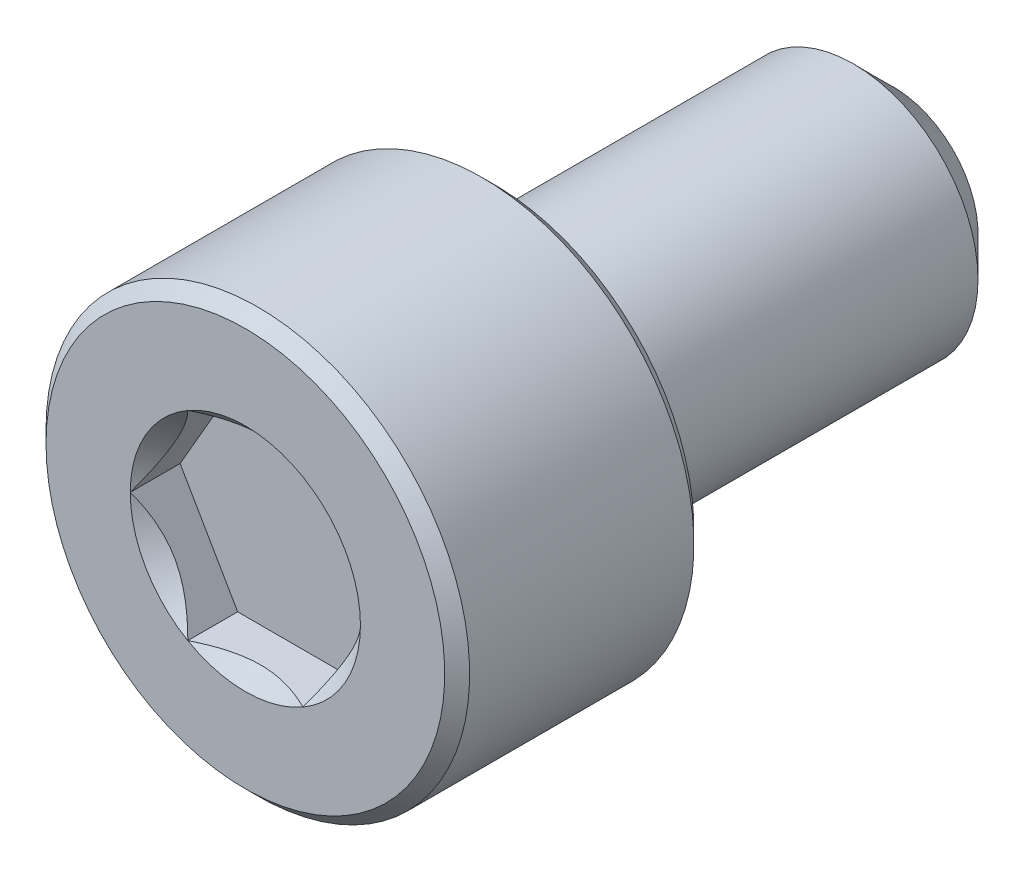
ISO-10303-21;
HEADER;
FILE_DESCRIPTION(('STEP AP214'),'2;1');
FILE_NAME('part.step','',(''),(''),'','','');
FILE_SCHEMA(('AUTOMOTIVE_DESIGN { 1 0 10303 214 1 1 1 1 }'));
ENDSEC;
DATA;
#1=APPLICATION_CONTEXT('core data for automotive mechanical design processes');
#2=APPLICATION_PROTOCOL_DEFINITION('international standard','automotive_design',2000,#1);
#3=PRODUCT_CONTEXT('',#1,'mechanical');
#4=PRODUCT('Part','Part','',(#3));
#5=PRODUCT_RELATED_PRODUCT_CATEGORY('part','',(#4));
#6=PRODUCT_DEFINITION_FORMATION('','',#4);
#7=PRODUCT_DEFINITION_CONTEXT('part definition',#1,'design');
#8=PRODUCT_DEFINITION('design','',#6,#7);
#9=PRODUCT_DEFINITION_SHAPE('','',#8);
#10=(LENGTH_UNIT() NAMED_UNIT(*) SI_UNIT(.MILLI.,.METRE.));
#11=(NAMED_UNIT(*) PLANE_ANGLE_UNIT() SI_UNIT($,.RADIAN.));
#12=(NAMED_UNIT(*) SI_UNIT($,.STERADIAN.) SOLID_ANGLE_UNIT());
#13=UNCERTAINTY_MEASURE_WITH_UNIT(LENGTH_MEASURE(1.E-05),#10,'distance_accuracy_value','');
#14=(GEOMETRIC_REPRESENTATION_CONTEXT(3) GLOBAL_UNCERTAINTY_ASSIGNED_CONTEXT((#13)) GLOBAL_UNIT_ASSIGNED_CONTEXT((#10,
#11,#12)) REPRESENTATION_CONTEXT('',''));
#15=CARTESIAN_POINT('',(0.,0.,0.));
#16=DIRECTION('',(0.,0.,1.));
#17=DIRECTION('',(1.,0.,0.));
#18=AXIS2_PLACEMENT_3D('',#15,#16,#17);
#19=CARTESIAN_POINT('',(0.,4.,6.5));
#20=DIRECTION('',(0.,0.,1.));
#21=DIRECTION('',(1.,0.,0.));
#22=AXIS2_PLACEMENT_3D('',#19,#20,#21);
#23=PLANE('',#22);
#24=CARTESIAN_POINT('',(0.,0.,6.5));
#25=DIRECTION('',(0.,0.,1.));
#26=DIRECTION('',(1.,0.,0.));
#27=AXIS2_PLACEMENT_3D('',#24,#25,#26);
#28=CIRCLE('',#27,2.3094010767585);
#29=CARTESIAN_POINT('',(2.3094010767585,0.,6.5));
#30=VERTEX_POINT('',#29);
#31=CARTESIAN_POINT('',(1.15470053837925,2.,6.5));
#32=VERTEX_POINT('',#31);
#33=EDGE_CURVE('E101',#30,#32,#28,.T.);
#34=ORIENTED_EDGE('',*,*,#33,.F.);
#35=CARTESIAN_POINT('',(1.15470053837925,-2.,6.5));
#36=VERTEX_POINT('',#35);
#37=EDGE_CURVE('E61',#36,#30,#28,.T.);
#38=ORIENTED_EDGE('',*,*,#37,.F.);
#39=CARTESIAN_POINT('',(-1.15470053837925,-2.,6.5));
#40=VERTEX_POINT('',#39);
#41=EDGE_CURVE('E331',#40,#36,#28,.T.);
#42=ORIENTED_EDGE('',*,*,#41,.F.);
#43=CARTESIAN_POINT('',(-2.3094010767585,0.,6.5));
#44=VERTEX_POINT('',#43);
#45=EDGE_CURVE('E68',#44,#40,#28,.T.);
#46=ORIENTED_EDGE('',*,*,#45,.F.);
#47=CARTESIAN_POINT('',(-1.15470053837925,2.,6.5));
#48=VERTEX_POINT('',#47);
#49=EDGE_CURVE('E139',#48,#44,#28,.T.);
#50=ORIENTED_EDGE('',*,*,#49,.F.);
#51=EDGE_CURVE('E111',#32,#48,#28,.T.);
#52=ORIENTED_EDGE('',*,*,#51,.F.);
#53=EDGE_LOOP('',(#34,#38,#42,#46,#50,#52));
#54=FACE_BOUND('',#53,.T.);
#55=CARTESIAN_POINT('',(0.,0.,6.5));
#56=DIRECTION('',(0.,0.,-1.));
#57=DIRECTION('',(-1.,0.,0.));
#58=AXIS2_PLACEMENT_3D('',#55,#56,#57);
#59=CIRCLE('',#58,4.);
#60=CARTESIAN_POINT('',(-4.,0.,6.5));
#61=VERTEX_POINT('',#60);
#62=EDGE_CURVE('E55',#61,#61,#59,.T.);
#63=ORIENTED_EDGE('',*,*,#62,.F.);
#64=EDGE_LOOP('',(#63));
#65=FACE_BOUND('',#64,.T.);
#66=ADVANCED_FACE('F41',(#54,#65),#23,.T.);
#67=CARTESIAN_POINT('',(0.,0.,6.25));
#68=DIRECTION('',(0.,0.,-1.));
#69=DIRECTION('',(-1.,0.,0.));
#70=AXIS2_PLACEMENT_3D('',#67,#68,#69);
#71=CONICAL_SURFACE('',#70,4.25,0.785398163397452);
#72=ORIENTED_EDGE('',*,*,#62,.T.);
#73=EDGE_LOOP('',(#72));
#74=FACE_BOUND('',#73,.T.);
#75=CARTESIAN_POINT('',(0.,0.,6.25));
#76=DIRECTION('',(0.,0.,-1.));
#77=DIRECTION('',(-1.,0.,0.));
#78=AXIS2_PLACEMENT_3D('',#75,#76,#77);
#79=CIRCLE('',#78,4.25);
#80=CARTESIAN_POINT('',(-4.25,0.,6.25));
#81=VERTEX_POINT('',#80);
#82=EDGE_CURVE('E299',#81,#81,#79,.T.);
#83=ORIENTED_EDGE('',*,*,#82,.F.);
#84=EDGE_LOOP('',(#83));
#85=FACE_BOUND('',#84,.T.);
#86=ADVANCED_FACE('F207',(#74,#85),#71,.T.);
#87=CARTESIAN_POINT('',(0.,0.,-6.5));
#88=DIRECTION('',(0.,0.,-1.));
#89=DIRECTION('',(-1.,0.,0.));
#90=AXIS2_PLACEMENT_3D('',#87,#88,#89);
#91=CYLINDRICAL_SURFACE('',#90,4.25);
#92=ORIENTED_EDGE('',*,*,#82,.T.);
#93=EDGE_LOOP('',(#92));
#94=FACE_BOUND('',#93,.T.);
#95=CARTESIAN_POINT('',(0.,0.,1.75));
#96=DIRECTION('',(0.,0.,-1.));
#97=DIRECTION('',(-1.,0.,0.));
#98=AXIS2_PLACEMENT_3D('',#95,#96,#97);
#99=CIRCLE('',#98,4.25);
#100=CARTESIAN_POINT('',(-4.25,0.,1.75));
#101=VERTEX_POINT('',#100);
#102=EDGE_CURVE('E295',#101,#101,#99,.T.);
#103=ORIENTED_EDGE('',*,*,#102,.F.);
#104=EDGE_LOOP('',(#103));
#105=FACE_BOUND('',#104,.T.);
#106=ADVANCED_FACE('F211',(#94,#105),#91,.T.);
#107=CARTESIAN_POINT('',(0.,0.,1.5));
#108=DIRECTION('',(0.,0.,1.));
#109=DIRECTION('',(1.,0.,0.));
#110=AXIS2_PLACEMENT_3D('',#107,#108,#109);
#111=CONICAL_SURFACE('',#110,4.,0.785398163397448);
#112=ORIENTED_EDGE('',*,*,#102,.T.);
#113=EDGE_LOOP('',(#112));
#114=FACE_BOUND('',#113,.T.);
#115=CARTESIAN_POINT('',(0.,0.,1.5));
#116=DIRECTION('',(0.,0.,-1.));
#117=DIRECTION('',(-1.,0.,0.));
#118=AXIS2_PLACEMENT_3D('',#115,#116,#117);
#119=CIRCLE('',#118,4.);
#120=CARTESIAN_POINT('',(-4.,0.,1.5));
#121=VERTEX_POINT('',#120);
#122=EDGE_CURVE('E291',#121,#121,#119,.T.);
#123=ORIENTED_EDGE('',*,*,#122,.F.);
#124=EDGE_LOOP('',(#123));
#125=FACE_BOUND('',#124,.T.);
#126=ADVANCED_FACE('F216',(#114,#125),#111,.T.);
#127=CARTESIAN_POINT('',(0.,4.,1.5));
#128=DIRECTION('',(0.,0.,-1.));
#129=DIRECTION('',(-1.,0.,0.));
#130=AXIS2_PLACEMENT_3D('',#127,#128,#129);
#131=PLANE('',#130);
#132=ORIENTED_EDGE('',*,*,#122,.T.);
#133=EDGE_LOOP('',(#132));
#134=FACE_BOUND('',#133,.T.);
#135=CARTESIAN_POINT('',(0.,0.,1.5));
#136=DIRECTION('',(0.,0.,-1.));
#137=DIRECTION('',(-1.,0.,0.));
#138=AXIS2_PLACEMENT_3D('',#135,#136,#137);
#139=CIRCLE('',#138,2.5);
#140=CARTESIAN_POINT('',(-2.5,0.,1.5));
#141=VERTEX_POINT('',#140);
#142=EDGE_CURVE('E287',#141,#141,#139,.T.);
#143=ORIENTED_EDGE('',*,*,#142,.F.);
#144=EDGE_LOOP('',(#143));
#145=FACE_BOUND('',#144,.T.);
#146=ADVANCED_FACE('F224',(#134,#145),#131,.T.);
#147=CARTESIAN_POINT('',(0.,0.,-6.5));
#148=DIRECTION('',(0.,0.,-1.));
#149=DIRECTION('',(-1.,0.,0.));
#150=AXIS2_PLACEMENT_3D('',#147,#148,#149);
#151=CYLINDRICAL_SURFACE('',#150,2.5);
#152=ORIENTED_EDGE('',*,*,#142,.T.);
#153=EDGE_LOOP('',(#152));
#154=FACE_BOUND('',#153,.T.);
#155=CARTESIAN_POINT('',(0.,0.,-5.69999999999999));
#156=DIRECTION('',(0.,0.,-1.));
#157=DIRECTION('',(-1.,0.,0.));
#158=AXIS2_PLACEMENT_3D('',#155,#156,#157);
#159=CIRCLE('',#158,2.5);
#160=CARTESIAN_POINT('',(-2.5,0.,-5.69999999999999));
#161=VERTEX_POINT('',#160);
#162=EDGE_CURVE('E283',#161,#161,#159,.T.);
#163=ORIENTED_EDGE('',*,*,#162,.F.);
#164=EDGE_LOOP('',(#163));
#165=FACE_BOUND('',#164,.T.);
#166=ADVANCED_FACE('F228',(#154,#165),#151,.T.);
#167=CARTESIAN_POINT('',(0.,0.,-6.5));
#168=DIRECTION('',(0.,0.,1.));
#169=DIRECTION('',(1.,0.,0.));
#170=AXIS2_PLACEMENT_3D('',#167,#168,#169);
#171=CONICAL_SURFACE('',#170,1.7,0.785398163397443);
#172=ORIENTED_EDGE('',*,*,#162,.T.);
#173=EDGE_LOOP('',(#172));
#174=FACE_BOUND('',#173,.T.);
#175=CARTESIAN_POINT('',(0.,0.,-6.5));
#176=DIRECTION('',(0.,0.,-1.));
#177=DIRECTION('',(-1.,0.,0.));
#178=AXIS2_PLACEMENT_3D('',#175,#176,#177);
#179=CIRCLE('',#178,1.7);
#180=CARTESIAN_POINT('',(-1.7,0.,-6.5));
#181=VERTEX_POINT('',#180);
#182=EDGE_CURVE('E259',#181,#181,#179,.T.);
#183=ORIENTED_EDGE('',*,*,#182,.F.);
#184=EDGE_LOOP('',(#183));
#185=FACE_BOUND('',#184,.T.);
#186=ADVANCED_FACE('F232',(#174,#185),#171,.T.);
#187=CARTESIAN_POINT('',(0.,1.7,-6.5));
#188=DIRECTION('',(0.,0.,-1.));
#189=DIRECTION('',(-1.,0.,0.));
#190=AXIS2_PLACEMENT_3D('',#187,#188,#189);
#191=PLANE('',#190);
#192=ORIENTED_EDGE('',*,*,#182,.T.);
#193=EDGE_LOOP('',(#192));
#194=FACE_BOUND('',#193,.T.);
#195=ADVANCED_FACE('F236',(#194),#191,.T.);
#196=CARTESIAN_POINT('',(0.,0.,6.5));
#197=DIRECTION('',(0.,0.,1.));
#198=DIRECTION('',(1.,0.,0.));
#199=AXIS2_PLACEMENT_3D('',#196,#197,#198);
#200=CONICAL_SURFACE('',#199,2.3094010767585,0.78539816339745);
#201=ORIENTED_EDGE('',*,*,#51,.T.);
#202=CARTESIAN_POINT('',(-2.33350792809313,2.,7.26391297333034));
#203=CARTESIAN_POINT('',(-2.27682524005105,2.,7.22088465819452));
#204=CARTESIAN_POINT('',(-2.21982863127677,2.,7.17826321968666));
#205=CARTESIAN_POINT('',(-2.10508243227164,2.,7.09401735382318));
#206=CARTESIAN_POINT('',(-2.04733265969732,2.,7.05239317509694));
#207=CARTESIAN_POINT('',(-1.93053250768749,2.,6.97002893909808));
#208=CARTESIAN_POINT('',(-1.87147552066419,2.,6.929298220564));
#209=CARTESIAN_POINT('',(-1.75236453496771,2.,6.84932648957119));
#210=CARTESIAN_POINT('',(-1.69231060660119,2.,6.81008537269831));
#211=CARTESIAN_POINT('',(-1.567471533448,2.,6.73116787888498));
#212=CARTESIAN_POINT('',(-1.50261611656329,2.,6.69160210237478));
#213=CARTESIAN_POINT('',(-1.37138716901082,2.,6.61502921587276));
#214=CARTESIAN_POINT('',(-1.30501336962871,2.,6.57802256351504));
#215=CARTESIAN_POINT('',(-1.17075263037878,2.,6.50736673923407));
#216=CARTESIAN_POINT('',(-1.10287104348427,2.,6.47370747514608));
#217=CARTESIAN_POINT('',(-0.96522809254686,2.,6.41049315112672));
#218=CARTESIAN_POINT('',(-0.895467367515903,2.,6.38093671652697));
#219=CARTESIAN_POINT('',(-0.760038155655725,2.,6.32931025785436));
#220=CARTESIAN_POINT('',(-0.694533426178473,2.,6.30681508107925));
#221=CARTESIAN_POINT('',(-0.561920164972266,2.,6.26707588844303));
#222=CARTESIAN_POINT('',(-0.494811525645962,2.,6.24983222594906));
#223=CARTESIAN_POINT('',(-0.360522211095494,2.,6.22179275650282));
#224=CARTESIAN_POINT('',(-0.293365389163157,2.,6.21088458822735));
#225=CARTESIAN_POINT('',(-0.158300090029279,2.,6.19573270261191));
#226=CARTESIAN_POINT('',(-0.0903917516002764,2.,6.19148777487641));
#227=CARTESIAN_POINT('',(0.0429020652606317,2.,6.18999114215311));
#228=CARTESIAN_POINT('',(0.108284684169079,2.,6.1924781450741));
#229=CARTESIAN_POINT('',(0.23850440969295,2.,6.20372439320255));
#230=CARTESIAN_POINT('',(0.303341463641696,2.,6.21248423709365));
#231=CARTESIAN_POINT('',(0.433098840648744,2.,6.23594152298035));
#232=CARTESIAN_POINT('',(0.498000415627631,2.,6.25074108464347));
#233=CARTESIAN_POINT('',(0.626381661351717,2.,6.28548203883061));
#234=CARTESIAN_POINT('',(0.689861439952175,2.,6.3054230398874));
#235=CARTESIAN_POINT('',(0.888345745687482,2.,6.37531214536041));
#236=CARTESIAN_POINT('',(1.02055912670982,2.,6.43316247106279));
#237=CARTESIAN_POINT('',(1.27879697777602,2.,6.56182319594991));
#238=CARTESIAN_POINT('',(1.40479723810912,2.,6.63267988107336));
#239=CARTESIAN_POINT('',(1.58692013279986,2.,6.74327963632549));
#240=CARTESIAN_POINT('',(1.64501521895223,2.,6.77983824352554));
#241=CARTESIAN_POINT('',(1.76020814703228,2.,6.85450591449783));
#242=CARTESIAN_POINT('',(1.81730591318335,2.,6.8926150953569));
#243=CARTESIAN_POINT('',(1.93017247334116,2.,6.96978646473081));
#244=CARTESIAN_POINT('',(1.9859482832833,2.,7.00883844345984));
#245=CARTESIAN_POINT('',(2.09673667795809,2.,7.08797979648984));
#246=CARTESIAN_POINT('',(2.15174946854703,2.,7.1280688822828));
#247=CARTESIAN_POINT('',(2.20644261038877,2.,7.16858297171107));
#248=B_SPLINE_CURVE_WITH_KNOTS('',3,(#202,#203,#204,#205,#206,#207,#208,#209,#210,#211,#212,
#213,#214,#215,#216,#217,#218,#219,#220,#221,#222,#223,#224,#225,#226,#227,#228,#229,#230,#231,
#232,#233,#234,#235,#236,#237,#238,#239,#240,#241,#242,#243,#244,#245,#246,#247),.UNSPECIFIED.,
.F.,.F.,(4,2,2,2,2,2,2,2,2,2,2,2,2,2,2,2,2,2,2,2,2,2,4),(0.,0.213497148294752,0.427046981593394,
0.642249974749849,0.857437855216921,1.08530552050929,1.31321382930987,1.54041273599371,
1.76753533413947,1.97513287362836,2.18274437898411,2.38655158594355,2.59032176649044,
2.78629737352115,2.98229168707252,3.18174703964799,3.38118721025193,3.81287365989454,
4.24612724012855,4.45203046308782,4.65794926316182,4.86220142187745,5.06639735899164),.UNSPECIFIED.);
#249=EDGE_CURVE('E12',#32,#48,#248,.F.);
#250=ORIENTED_EDGE('',*,*,#249,.F.);
#251=EDGE_LOOP('',(#201,#250));
#252=FACE_BOUND('',#251,.T.);
#253=ADVANCED_FACE('F115',(#252),#200,.F.);
#254=ORIENTED_EDGE('',*,*,#49,.T.);
#255=CARTESIAN_POINT('',(-1.15458506832541,2.0002,6.50011547871366));
#256=CARTESIAN_POINT('',(-1.19427965103064,1.93144696596929,6.46045309022559));
#257=CARTESIAN_POINT('',(-1.23463799837204,1.86154425786449,6.42311998228416));
#258=CARTESIAN_POINT('',(-1.31693321846145,1.71900475544956,6.35476368513614));
#259=CARTESIAN_POINT('',(-1.35887791933134,1.64635440243464,6.32377853373722));
#260=CARTESIAN_POINT('',(-1.44345742638069,1.49985839894603,6.27070021654414));
#261=CARTESIAN_POINT('',(-1.48607068799507,1.42605006475371,6.24847362717661));
#262=CARTESIAN_POINT('',(-1.57223542169503,1.27680836816474,6.21422881667508));
#263=CARTESIAN_POINT('',(-1.61578426088223,1.20137956608185,6.20218502914414));
#264=CARTESIAN_POINT('',(-1.69083694766536,1.07138449932892,6.19131851190557));
#265=CARTESIAN_POINT('',(-1.72224381117151,1.01698621602989,6.18970975360997));
#266=CARTESIAN_POINT('',(-1.78500621460364,0.908278544480308,6.19241887759871));
#267=CARTESIAN_POINT('',(-1.81636173267754,0.853969194078662,6.19673883775797));
#268=CARTESIAN_POINT('',(-1.87877671565355,0.745863272410663,6.21105956740991));
#269=CARTESIAN_POINT('',(-1.90983580972306,0.692067343445209,6.22106669276201));
#270=CARTESIAN_POINT('',(-1.97141691651547,0.585405737694428,6.24621243024966));
#271=CARTESIAN_POINT('',(-2.00193897021859,0.532539989929289,6.26135064904224));
#272=CARTESIAN_POINT('',(-2.08012358375727,0.397120266910157,6.30629450342919));
#273=CARTESIAN_POINT('',(-2.12730124240478,0.315406165150523,6.33948883942582));
#274=CARTESIAN_POINT('',(-2.19667172615922,0.195252962742199,6.39552582317137));
#275=CARTESIAN_POINT('',(-2.21953238052245,0.155657147890824,6.41521470294694));
#276=CARTESIAN_POINT('',(-2.26483018959123,0.0771990411121286,6.45638731836487));
#277=CARTESIAN_POINT('',(-2.28726759416161,0.0383363164062604,6.47786995165125));
#278=CARTESIAN_POINT('',(-2.30951654681234,-0.000199999999999359,6.50011547871366));
#279=B_SPLINE_CURVE_WITH_KNOTS('',3,(#255,#256,#257,#258,#259,#260,#261,#262,#263,#264,#265,
#266,#267,#268,#269,#270,#271,#272,#273,#274,#275,#276,#277,#278),.UNSPECIFIED.,.F.,.F.,(4,2,2,
2,2,2,2,2,2,2,2,4),(0.,0.266420613771063,0.534393751523388,0.798110374376913,1.06116288956936,
1.24939906803721,1.43770123566247,1.62621426093931,1.81471283831913,2.11415604834145,
2.2634717071779,2.41269626969771),.UNSPECIFIED.);
#280=EDGE_CURVE('E110',#48,#44,#279,.T.);
#281=ORIENTED_EDGE('',*,*,#280,.F.);
#282=EDGE_LOOP('',(#254,#281));
#283=FACE_BOUND('',#282,.T.);
#284=ADVANCED_FACE('F342',(#283),#200,.F.);
#285=ORIENTED_EDGE('',*,*,#45,.T.);
#286=CARTESIAN_POINT('',(-2.30951654681234,0.000200000000000642,6.50011547871366));
#287=CARTESIAN_POINT('',(-2.26982196410711,-0.0685530340307052,6.46045309022559));
#288=CARTESIAN_POINT('',(-2.22946361676572,-0.138455742135511,6.42311998228416));
#289=CARTESIAN_POINT('',(-2.1471683966763,-0.280995244550436,6.35476368513614));
#290=CARTESIAN_POINT('',(-2.10522369580642,-0.353645597565358,6.32377853373722));
#291=CARTESIAN_POINT('',(-2.02064418875706,-0.500141601053971,6.27070021654414));
#292=CARTESIAN_POINT('',(-1.97803092714269,-0.573949935246295,6.24847362717661));
#293=CARTESIAN_POINT('',(-1.89186619344273,-0.723191631835264,6.21422881667508));
#294=CARTESIAN_POINT('',(-1.84831735425552,-0.798620433918152,6.20218502914414));
#295=CARTESIAN_POINT('',(-1.77326466747239,-0.92861550067108,6.19131851190557));
#296=CARTESIAN_POINT('',(-1.74185780396625,-0.983013783970109,6.18970975360997));
#297=CARTESIAN_POINT('',(-1.67909540053412,-1.09172145551969,6.19241887759871));
#298=CARTESIAN_POINT('',(-1.64773988246021,-1.14603080592134,6.19673883775797));
#299=CARTESIAN_POINT('',(-1.5853248994842,-1.25413672758934,6.21105956740991));
#300=CARTESIAN_POINT('',(-1.55426580541469,-1.30793265655479,6.22106669276201));
#301=CARTESIAN_POINT('',(-1.49268469862228,-1.41459426230557,6.24621243024966));
#302=CARTESIAN_POINT('',(-1.46216264491916,-1.46746001007071,6.26135064904224));
#303=CARTESIAN_POINT('',(-1.38397803138048,-1.60287973308984,6.30629450342919));
#304=CARTESIAN_POINT('',(-1.33680037273297,-1.68459383484948,6.33948883942582));
#305=CARTESIAN_POINT('',(-1.26742988897853,-1.8047470372578,6.39552582317137));
#306=CARTESIAN_POINT('',(-1.24456923461531,-1.84434285210918,6.41521470294694));
#307=CARTESIAN_POINT('',(-1.19927142554652,-1.92280095888787,6.45638731836487));
#308=CARTESIAN_POINT('',(-1.17683402097614,-1.96166368359374,6.47786995165125));
#309=CARTESIAN_POINT('',(-1.15458506832541,-2.0002,6.50011547871366));
#310=B_SPLINE_CURVE_WITH_KNOTS('',3,(#286,#287,#288,#289,#290,#291,#292,#293,#294,#295,#296,
#297,#298,#299,#300,#301,#302,#303,#304,#305,#306,#307,#308,#309),.UNSPECIFIED.,.F.,.F.,(4,2,2,
2,2,2,2,2,2,2,2,4),(0.,0.266420613771064,0.53439375152339,0.798110374376916,1.06116288956937,
1.24939906803722,1.43770123566248,1.62621426093932,1.81471283831913,2.11415604834145,
2.26347170717791,2.41269626969771),.UNSPECIFIED.);
#311=EDGE_CURVE('E151',#44,#40,#310,.T.);
#312=ORIENTED_EDGE('',*,*,#311,.F.);
#313=EDGE_LOOP('',(#285,#312));
#314=FACE_BOUND('',#313,.T.);
#315=ADVANCED_FACE('F337',(#314),#200,.F.);
#316=ORIENTED_EDGE('',*,*,#41,.T.);
#317=CARTESIAN_POINT('',(-2.33350792809314,-2.,7.26391297333034));
#318=CARTESIAN_POINT('',(-2.27682524005105,-2.,7.22088465819452));
#319=CARTESIAN_POINT('',(-2.21982863127677,-2.,7.17826321968666));
#320=CARTESIAN_POINT('',(-2.10508243227164,-2.,7.09401735382318));
#321=CARTESIAN_POINT('',(-2.04733265969732,-2.,7.05239317509694));
#322=CARTESIAN_POINT('',(-1.9305325076875,-2.,6.97002893909808));
#323=CARTESIAN_POINT('',(-1.87147552066419,-2.,6.929298220564));
#324=CARTESIAN_POINT('',(-1.75236453496771,-2.,6.84932648957119));
#325=CARTESIAN_POINT('',(-1.69231060660119,-2.,6.81008537269831));
#326=CARTESIAN_POINT('',(-1.567471533448,-2.,6.73116787888498));
#327=CARTESIAN_POINT('',(-1.50261611656329,-2.,6.69160210237478));
#328=CARTESIAN_POINT('',(-1.37138716901082,-2.,6.61502921587276));
#329=CARTESIAN_POINT('',(-1.30501336962871,-2.,6.57802256351504));
#330=CARTESIAN_POINT('',(-1.17075263037878,-2.,6.50736673923407));
#331=CARTESIAN_POINT('',(-1.10287104348427,-2.,6.47370747514608));
#332=CARTESIAN_POINT('',(-0.96522809254686,-2.,6.41049315112672));
#333=CARTESIAN_POINT('',(-0.895467367515904,-2.,6.38093671652697));
#334=CARTESIAN_POINT('',(-0.760038155655725,-2.,6.32931025785436));
#335=CARTESIAN_POINT('',(-0.694533426178473,-2.,6.30681508107925));
#336=CARTESIAN_POINT('',(-0.561920164972266,-2.,6.26707588844303));
#337=CARTESIAN_POINT('',(-0.494811525645962,-2.,6.24983222594905));
#338=CARTESIAN_POINT('',(-0.360522211095493,-2.,6.22179275650282));
#339=CARTESIAN_POINT('',(-0.293365389163156,-2.,6.21088458822734));
#340=CARTESIAN_POINT('',(-0.158300090029278,-2.,6.19573270261191));
#341=CARTESIAN_POINT('',(-0.090391751600276,-2.,6.19148777487641));
#342=CARTESIAN_POINT('',(0.0429020652606321,-2.,6.18999114215311));
#343=CARTESIAN_POINT('',(0.10828468416908,-2.,6.1924781450741));
#344=CARTESIAN_POINT('',(0.238504409692951,-2.,6.20372439320255));
#345=CARTESIAN_POINT('',(0.303341463641697,-2.,6.21248423709365));
#346=CARTESIAN_POINT('',(0.433098840648745,-2.,6.23594152298035));
#347=CARTESIAN_POINT('',(0.498000415627632,-2.,6.25074108464347));
#348=CARTESIAN_POINT('',(0.626381661351717,-2.,6.28548203883061));
#349=CARTESIAN_POINT('',(0.689861439952175,-2.,6.3054230398874));
#350=CARTESIAN_POINT('',(0.888345745687483,-2.,6.37531214536041));
#351=CARTESIAN_POINT('',(1.02055912670982,-2.,6.43316247106279));
#352=CARTESIAN_POINT('',(1.27879697777602,-2.,6.56182319594991));
#353=CARTESIAN_POINT('',(1.40479723810912,-2.,6.63267988107336));
#354=CARTESIAN_POINT('',(1.58692013279986,-2.,6.74327963632549));
#355=CARTESIAN_POINT('',(1.64501521895223,-2.,6.77983824352554));
#356=CARTESIAN_POINT('',(1.76020814703228,-2.,6.85450591449783));
#357=CARTESIAN_POINT('',(1.81730591318335,-2.,6.8926150953569));
#358=CARTESIAN_POINT('',(1.93017247334116,-2.,6.96978646473081));
#359=CARTESIAN_POINT('',(1.9859482832833,-2.,7.00883844345984));
#360=CARTESIAN_POINT('',(2.09673667795809,-2.,7.08797979648984));
#361=CARTESIAN_POINT('',(2.15174946854703,-2.,7.1280688822828));
#362=CARTESIAN_POINT('',(2.20644261038877,-2.,7.16858297171107));
#363=B_SPLINE_CURVE_WITH_KNOTS('',3,(#317,#318,#319,#320,#321,#322,#323,#324,#325,#326,#327,
#328,#329,#330,#331,#332,#333,#334,#335,#336,#337,#338,#339,#340,#341,#342,#343,#344,#345,#346,
#347,#348,#349,#350,#351,#352,#353,#354,#355,#356,#357,#358,#359,#360,#361,#362),.UNSPECIFIED.,
.F.,.F.,(4,2,2,2,2,2,2,2,2,2,2,2,2,2,2,2,2,2,2,2,2,2,4),(0.,0.213497148294753,0.427046981593394,
0.642249974749849,0.857437855216922,1.08530552050929,1.31321382930987,1.54041273599371,
1.76753533413947,1.97513287362836,2.18274437898411,2.38655158594355,2.59032176649044,
2.78629737352115,2.98229168707252,3.18174703964799,3.38118721025193,3.81287365989454,
4.24612724012855,4.45203046308782,4.65794926316182,4.86220142187745,5.06639735899164),.UNSPECIFIED.);
#364=EDGE_CURVE('E171',#40,#36,#363,.T.);
#365=ORIENTED_EDGE('',*,*,#364,.F.);
#366=EDGE_LOOP('',(#316,#365));
#367=FACE_BOUND('',#366,.T.);
#368=ADVANCED_FACE('F332',(#367),#200,.F.);
#369=ORIENTED_EDGE('',*,*,#37,.T.);
#370=CARTESIAN_POINT('',(1.15458506832541,-2.0002,6.50011547871366));
#371=CARTESIAN_POINT('',(1.19427965103064,-1.93144696596929,6.46045309022559));
#372=CARTESIAN_POINT('',(1.23463799837204,-1.86154425786449,6.42311998228416));
#373=CARTESIAN_POINT('',(1.31693321846145,-1.71900475544956,6.35476368513614));
#374=CARTESIAN_POINT('',(1.35887791933134,-1.64635440243464,6.32377853373722));
#375=CARTESIAN_POINT('',(1.44345742638069,-1.49985839894603,6.27070021654414));
#376=CARTESIAN_POINT('',(1.48607068799507,-1.42605006475371,6.24847362717661));
#377=CARTESIAN_POINT('',(1.57223542169502,-1.27680836816474,6.21422881667508));
#378=CARTESIAN_POINT('',(1.61578426088223,-1.20137956608185,6.20218502914414));
#379=CARTESIAN_POINT('',(1.69083694766536,-1.07138449932892,6.19131851190557));
#380=CARTESIAN_POINT('',(1.72224381117151,-1.01698621602989,6.18970975360997));
#381=CARTESIAN_POINT('',(1.78500621460364,-0.908278544480307,6.19241887759871));
#382=CARTESIAN_POINT('',(1.81636173267754,-0.853969194078662,6.19673883775797));
#383=CARTESIAN_POINT('',(1.87877671565355,-0.745863272410662,6.21105956740991));
#384=CARTESIAN_POINT('',(1.90983580972306,-0.692067343445208,6.22106669276201));
#385=CARTESIAN_POINT('',(1.97141691651547,-0.585405737694427,6.24621243024966));
#386=CARTESIAN_POINT('',(2.00193897021859,-0.532539989929288,6.26135064904224));
#387=CARTESIAN_POINT('',(2.08012358375727,-0.397120266910156,6.30629450342919));
#388=CARTESIAN_POINT('',(2.12730124240478,-0.315406165150522,6.33948883942582));
#389=CARTESIAN_POINT('',(2.19667172615922,-0.195252962742198,6.39552582317137));
#390=CARTESIAN_POINT('',(2.21953238052245,-0.155657147890823,6.41521470294694));
#391=CARTESIAN_POINT('',(2.26483018959123,-0.0771990411121277,6.45638731836487));
#392=CARTESIAN_POINT('',(2.28726759416161,-0.0383363164062597,6.47786995165125));
#393=CARTESIAN_POINT('',(2.30951654681234,0.000200000000000026,6.50011547871366));
#394=B_SPLINE_CURVE_WITH_KNOTS('',3,(#370,#371,#372,#373,#374,#375,#376,#377,#378,#379,#380,
#381,#382,#383,#384,#385,#386,#387,#388,#389,#390,#391,#392,#393),.UNSPECIFIED.,.F.,.F.,(4,2,2,
2,2,2,2,2,2,2,2,4),(0.,0.266420613771063,0.534393751523388,0.798110374376913,1.06116288956936,
1.24939906803721,1.43770123566247,1.62621426093931,1.81471283831913,2.11415604834145,
2.2634717071779,2.41269626969771),.UNSPECIFIED.);
#395=EDGE_CURVE('E128',#36,#30,#394,.T.);
#396=ORIENTED_EDGE('',*,*,#395,.F.);
#397=EDGE_LOOP('',(#369,#396));
#398=FACE_BOUND('',#397,.T.);
#399=ADVANCED_FACE('F164',(#398),#200,.F.);
#400=ORIENTED_EDGE('',*,*,#33,.T.);
#401=CARTESIAN_POINT('',(2.30951654681234,-0.000199999999999628,6.50011547871366));
#402=CARTESIAN_POINT('',(2.26982196410711,0.0685530340307059,6.46045309022559));
#403=CARTESIAN_POINT('',(2.22946361676572,0.138455742135512,6.42311998228416));
#404=CARTESIAN_POINT('',(2.1471683966763,0.280995244550437,6.35476368513614));
#405=CARTESIAN_POINT('',(2.10522369580642,0.353645597565359,6.32377853373722));
#406=CARTESIAN_POINT('',(2.02064418875706,0.500141601053972,6.27070021654414));
#407=CARTESIAN_POINT('',(1.97803092714269,0.573949935246295,6.24847362717661));
#408=CARTESIAN_POINT('',(1.89186619344273,0.723191631835265,6.21422881667508));
#409=CARTESIAN_POINT('',(1.84831735425552,0.798620433918153,6.20218502914414));
#410=CARTESIAN_POINT('',(1.7732646674724,0.92861550067108,6.19131851190557));
#411=CARTESIAN_POINT('',(1.74185780396625,0.98301378397011,6.18970975360997));
#412=CARTESIAN_POINT('',(1.67909540053412,1.09172145551969,6.19241887759871));
#413=CARTESIAN_POINT('',(1.64773988246021,1.14603080592134,6.19673883775797));
#414=CARTESIAN_POINT('',(1.5853248994842,1.25413672758934,6.21105956740991));
#415=CARTESIAN_POINT('',(1.55426580541469,1.30793265655479,6.22106669276201));
#416=CARTESIAN_POINT('',(1.49268469862228,1.41459426230557,6.24621243024966));
#417=CARTESIAN_POINT('',(1.46216264491917,1.46746001007071,6.26135064904224));
#418=CARTESIAN_POINT('',(1.38397803138049,1.60287973308985,6.30629450342919));
#419=CARTESIAN_POINT('',(1.33680037273297,1.68459383484948,6.33948883942582));
#420=CARTESIAN_POINT('',(1.26742988897853,1.8047470372578,6.39552582317137));
#421=CARTESIAN_POINT('',(1.24456923461531,1.84434285210918,6.41521470294694));
#422=CARTESIAN_POINT('',(1.19927142554652,1.92280095888787,6.45638731836487));
#423=CARTESIAN_POINT('',(1.17683402097614,1.96166368359374,6.47786995165125));
#424=CARTESIAN_POINT('',(1.15458506832541,2.0002,6.50011547871366));
#425=B_SPLINE_CURVE_WITH_KNOTS('',3,(#401,#402,#403,#404,#405,#406,#407,#408,#409,#410,#411,
#412,#413,#414,#415,#416,#417,#418,#419,#420,#421,#422,#423,#424),.UNSPECIFIED.,.F.,.F.,(4,2,2,
2,2,2,2,2,2,2,2,4),(0.,0.266420613771064,0.534393751523389,0.798110374376915,1.06116288956936,
1.24939906803722,1.43770123566247,1.62621426093932,1.81471283831913,2.11415604834145,
2.2634717071779,2.41269626969771),.UNSPECIFIED.);
#426=EDGE_CURVE('E105',#30,#32,#425,.T.);
#427=ORIENTED_EDGE('',*,*,#426,.F.);
#428=EDGE_LOOP('',(#400,#427));
#429=FACE_BOUND('',#428,.T.);
#430=ADVANCED_FACE('F103',(#429),#200,.F.);
#431=CARTESIAN_POINT('',(0.,4.,5.5));
#432=DIRECTION('',(0.,0.,1.));
#433=DIRECTION('',(1.,0.,0.));
#434=AXIS2_PLACEMENT_3D('',#431,#432,#433);
#435=PLANE('',#434);
#436=DIRECTION('',(0.5,-0.866025403784439,0.));
#437=VECTOR('',#436,1.);
#438=CARTESIAN_POINT('',(2.3094010767585,0.,5.5));
#439=LINE('',#438,#437);
#440=CARTESIAN_POINT('',(1.15470053837925,2.,5.5));
#441=VERTEX_POINT('',#440);
#442=CARTESIAN_POINT('',(2.3094010767585,0.,5.5));
#443=VERTEX_POINT('',#442);
#444=EDGE_CURVE('E251',#441,#443,#439,.T.);
#445=ORIENTED_EDGE('',*,*,#444,.F.);
#446=DIRECTION('',(1.,0.,0.));
#447=VECTOR('',#446,1.);
#448=CARTESIAN_POINT('',(1.15470053837925,2.,5.5));
#449=LINE('',#448,#447);
#450=CARTESIAN_POINT('',(-1.15470053837925,2.,5.5));
#451=VERTEX_POINT('',#450);
#452=EDGE_CURVE('E132',#451,#441,#449,.T.);
#453=ORIENTED_EDGE('',*,*,#452,.F.);
#454=DIRECTION('',(0.5,0.866025403784439,0.));
#455=VECTOR('',#454,1.);
#456=CARTESIAN_POINT('',(-1.15470053837925,2.,5.5));
#457=LINE('',#456,#455);
#458=CARTESIAN_POINT('',(-2.3094010767585,0.,5.5));
#459=VERTEX_POINT('',#458);
#460=EDGE_CURVE('E267',#459,#451,#457,.T.);
#461=ORIENTED_EDGE('',*,*,#460,.F.);
#462=DIRECTION('',(-0.5,0.866025403784439,0.));
#463=VECTOR('',#462,1.);
#464=CARTESIAN_POINT('',(-2.3094010767585,0.,5.5));
#465=LINE('',#464,#463);
#466=CARTESIAN_POINT('',(-1.15470053837925,-2.,5.5));
#467=VERTEX_POINT('',#466);
#468=EDGE_CURVE('E318',#467,#459,#465,.T.);
#469=ORIENTED_EDGE('',*,*,#468,.F.);
#470=DIRECTION('',(-1.,0.,0.));
#471=VECTOR('',#470,1.);
#472=CARTESIAN_POINT('',(-1.15470053837925,-2.,5.5));
#473=LINE('',#472,#471);
#474=CARTESIAN_POINT('',(1.15470053837925,-2.,5.5));
#475=VERTEX_POINT('',#474);
#476=EDGE_CURVE('E261',#475,#467,#473,.T.);
#477=ORIENTED_EDGE('',*,*,#476,.F.);
#478=DIRECTION('',(-0.5,-0.866025403784439,0.));
#479=VECTOR('',#478,1.);
#480=CARTESIAN_POINT('',(1.15470053837925,-2.,5.5));
#481=LINE('',#480,#479);
#482=EDGE_CURVE('E254',#443,#475,#481,.T.);
#483=ORIENTED_EDGE('',*,*,#482,.F.);
#484=EDGE_LOOP('',(#445,#453,#461,#469,#477,#483));
#485=FACE_BOUND('',#484,.T.);
#486=ADVANCED_FACE('F163',(#485),#435,.T.);
#487=CARTESIAN_POINT('',(1.15470053837925,2.,-1.61010092660779));
#488=DIRECTION('',(0.,1.,0.));
#489=DIRECTION('',(-1.,0.,0.));
#490=AXIS2_PLACEMENT_3D('',#487,#488,#489);
#491=PLANE('',#490);
#492=DIRECTION('',(0.,0.,1.));
#493=VECTOR('',#492,1.);
#494=CARTESIAN_POINT('',(1.15470053837925,2.,-1.61010092660779));
#495=LINE('',#494,#493);
#496=EDGE_CURVE('E124',#441,#32,#495,.T.);
#497=ORIENTED_EDGE('',*,*,#496,.T.);
#498=ORIENTED_EDGE('',*,*,#249,.T.);
#499=DIRECTION('',(0.,0.,1.));
#500=VECTOR('',#499,1.);
#501=CARTESIAN_POINT('',(-1.15470053837925,2.,-1.61010092660779));
#502=LINE('',#501,#500);
#503=EDGE_CURVE('E135',#451,#48,#502,.T.);
#504=ORIENTED_EDGE('',*,*,#503,.F.);
#505=ORIENTED_EDGE('',*,*,#452,.T.);
#506=EDGE_LOOP('',(#497,#498,#504,#505));
#507=FACE_BOUND('',#506,.T.);
#508=ADVANCED_FACE('F130',(#507),#491,.F.);
#509=CARTESIAN_POINT('',(-1.15470053837925,2.,-1.61010092660779));
#510=DIRECTION('',(-0.866025403784438,0.5,0.));
#511=DIRECTION('',(-0.5,-0.866025403784439,0.));
#512=AXIS2_PLACEMENT_3D('',#509,#510,#511);
#513=PLANE('',#512);
#514=ORIENTED_EDGE('',*,*,#503,.T.);
#515=ORIENTED_EDGE('',*,*,#280,.T.);
#516=DIRECTION('',(0.,0.,1.));
#517=VECTOR('',#516,1.);
#518=CARTESIAN_POINT('',(-2.3094010767585,0.,-1.61010092660779));
#519=LINE('',#518,#517);
#520=EDGE_CURVE('E275',#459,#44,#519,.T.);
#521=ORIENTED_EDGE('',*,*,#520,.F.);
#522=ORIENTED_EDGE('',*,*,#460,.T.);
#523=EDGE_LOOP('',(#514,#515,#521,#522));
#524=FACE_BOUND('',#523,.T.);
#525=ADVANCED_FACE('F158',(#524),#513,.F.);
#526=CARTESIAN_POINT('',(-2.3094010767585,0.,-1.61010092660779));
#527=DIRECTION('',(-0.866025403784439,-0.5,0.));
#528=DIRECTION('',(0.5,-0.866025403784439,0.));
#529=AXIS2_PLACEMENT_3D('',#526,#527,#528);
#530=PLANE('',#529);
#531=ORIENTED_EDGE('',*,*,#520,.T.);
#532=ORIENTED_EDGE('',*,*,#311,.T.);
#533=DIRECTION('',(0.,0.,1.));
#534=VECTOR('',#533,1.);
#535=CARTESIAN_POINT('',(-1.15470053837925,-2.,-1.61010092660779));
#536=LINE('',#535,#534);
#537=EDGE_CURVE('E271',#467,#40,#536,.T.);
#538=ORIENTED_EDGE('',*,*,#537,.F.);
#539=ORIENTED_EDGE('',*,*,#468,.T.);
#540=EDGE_LOOP('',(#531,#532,#538,#539));
#541=FACE_BOUND('',#540,.T.);
#542=ADVANCED_FACE('F196',(#541),#530,.F.);
#543=CARTESIAN_POINT('',(-1.15470053837925,-2.,-1.61010092660779));
#544=DIRECTION('',(0.,-1.,0.));
#545=DIRECTION('',(0.,0.,-1.));
#546=AXIS2_PLACEMENT_3D('',#543,#544,#545);
#547=PLANE('',#546);
#548=ORIENTED_EDGE('',*,*,#537,.T.);
#549=ORIENTED_EDGE('',*,*,#364,.T.);
#550=DIRECTION('',(0.,0.,1.));
#551=VECTOR('',#550,1.);
#552=CARTESIAN_POINT('',(1.15470053837925,-2.,-1.61010092660779));
#553=LINE('',#552,#551);
#554=EDGE_CURVE('E268',#475,#36,#553,.T.);
#555=ORIENTED_EDGE('',*,*,#554,.F.);
#556=ORIENTED_EDGE('',*,*,#476,.T.);
#557=EDGE_LOOP('',(#548,#549,#555,#556));
#558=FACE_BOUND('',#557,.T.);
#559=ADVANCED_FACE('F192',(#558),#547,.F.);
#560=CARTESIAN_POINT('',(1.15470053837925,-2.,-1.61010092660779));
#561=DIRECTION('',(0.866025403784439,-0.5,0.));
#562=DIRECTION('',(0.5,0.866025403784439,0.));
#563=AXIS2_PLACEMENT_3D('',#560,#561,#562);
#564=PLANE('',#563);
#565=ORIENTED_EDGE('',*,*,#554,.T.);
#566=ORIENTED_EDGE('',*,*,#395,.T.);
#567=DIRECTION('',(0.,0.,1.));
#568=VECTOR('',#567,1.);
#569=CARTESIAN_POINT('',(2.3094010767585,0.,-1.61010092660779));
#570=LINE('',#569,#568);
#571=EDGE_CURVE('E126',#443,#30,#570,.T.);
#572=ORIENTED_EDGE('',*,*,#571,.F.);
#573=ORIENTED_EDGE('',*,*,#482,.T.);
#574=EDGE_LOOP('',(#565,#566,#572,#573));
#575=FACE_BOUND('',#574,.T.);
#576=ADVANCED_FACE('F189',(#575),#564,.F.);
#577=CARTESIAN_POINT('',(2.3094010767585,0.,-1.61010092660779));
#578=DIRECTION('',(0.866025403784439,0.5,0.));
#579=DIRECTION('',(-0.5,0.866025403784439,0.));
#580=AXIS2_PLACEMENT_3D('',#577,#578,#579);
#581=PLANE('',#580);
#582=ORIENTED_EDGE('',*,*,#571,.T.);
#583=ORIENTED_EDGE('',*,*,#426,.T.);
#584=ORIENTED_EDGE('',*,*,#496,.F.);
#585=ORIENTED_EDGE('',*,*,#444,.T.);
#586=EDGE_LOOP('',(#582,#583,#584,#585));
#587=FACE_BOUND('',#586,.T.);
#588=ADVANCED_FACE('F123',(#587),#581,.F.);
#589=CLOSED_SHELL('',(#66,#86,#106,#126,#146,#166,#186,#195,#253,#284,#315,#368,#399,#430,#486,
#508,#525,#542,#559,#576,#588));
#590=MANIFOLD_SOLID_BREP('B2',#589);
#591=ADVANCED_BREP_SHAPE_REPRESENTATION('',(#18,#590),#14);
#592=SHAPE_DEFINITION_REPRESENTATION(#9,#591);
ENDSEC;
END-ISO-10303-21;
